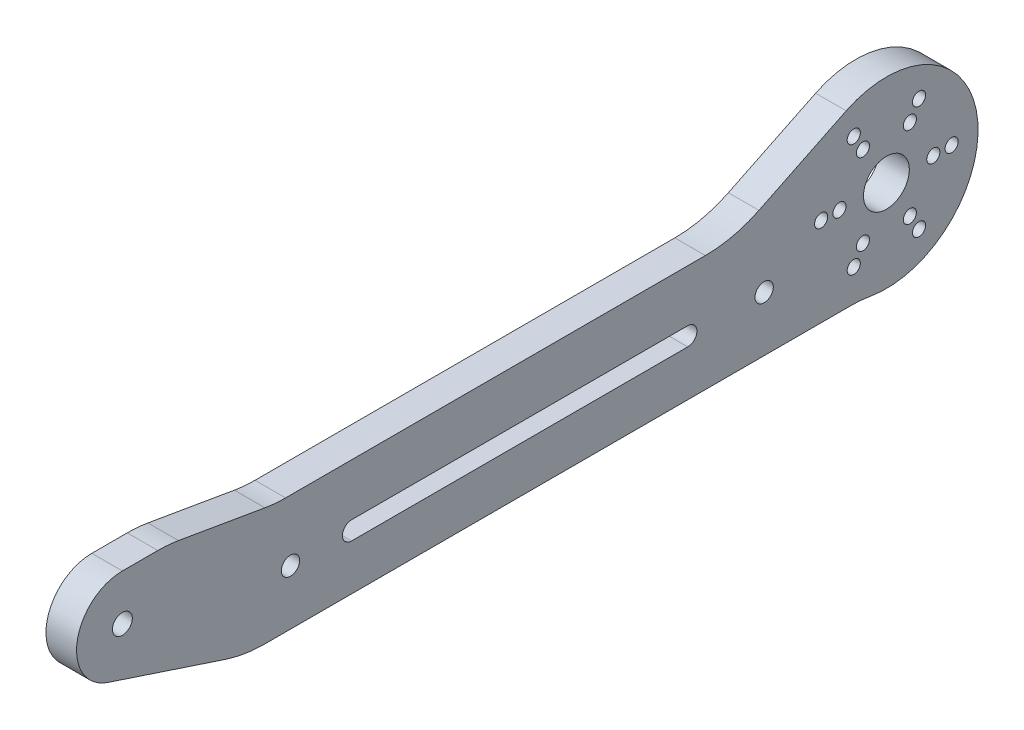
ISO-10303-21;
HEADER;
FILE_DESCRIPTION(('STEP AP214'),'2;1');
FILE_NAME('part.step','',(''),(''),'','','');
FILE_SCHEMA(('AUTOMOTIVE_DESIGN { 1 0 10303 214 1 1 1 1 }'));
ENDSEC;
DATA;
#1=APPLICATION_CONTEXT('core data for automotive mechanical design processes');
#2=APPLICATION_PROTOCOL_DEFINITION('international standard','automotive_design',2000,#1);
#3=PRODUCT_CONTEXT('',#1,'mechanical');
#4=PRODUCT('Part','Part','',(#3));
#5=PRODUCT_RELATED_PRODUCT_CATEGORY('part','',(#4));
#6=PRODUCT_DEFINITION_FORMATION('','',#4);
#7=PRODUCT_DEFINITION_CONTEXT('part definition',#1,'design');
#8=PRODUCT_DEFINITION('design','',#6,#7);
#9=PRODUCT_DEFINITION_SHAPE('','',#8);
#10=(LENGTH_UNIT() NAMED_UNIT(*) SI_UNIT(.MILLI.,.METRE.));
#11=(NAMED_UNIT(*) PLANE_ANGLE_UNIT() SI_UNIT($,.RADIAN.));
#12=(NAMED_UNIT(*) SI_UNIT($,.STERADIAN.) SOLID_ANGLE_UNIT());
#13=UNCERTAINTY_MEASURE_WITH_UNIT(LENGTH_MEASURE(1.E-05),#10,'distance_accuracy_value','');
#14=(GEOMETRIC_REPRESENTATION_CONTEXT(3) GLOBAL_UNCERTAINTY_ASSIGNED_CONTEXT((#13)) GLOBAL_UNIT_ASSIGNED_CONTEXT((#10,
#11,#12)) REPRESENTATION_CONTEXT('',''));
#15=CARTESIAN_POINT('',(0.,0.,0.));
#16=DIRECTION('',(0.,0.,1.));
#17=DIRECTION('',(1.,0.,0.));
#18=AXIS2_PLACEMENT_3D('',#15,#16,#17);
#19=CARTESIAN_POINT('',(-2.5,0.,0.));
#20=DIRECTION('',(1.,0.,0.));
#21=DIRECTION('',(0.,0.,-1.));
#22=AXIS2_PLACEMENT_3D('',#19,#20,#21);
#23=PLANE('',#22);
#24=CARTESIAN_POINT('',(-2.5,0.,125.));
#25=DIRECTION('',(-1.,0.,0.));
#26=DIRECTION('',(0.,0.,1.));
#27=AXIS2_PLACEMENT_3D('',#24,#25,#26);
#28=CIRCLE('',#27,1.62500000000002);
#29=CARTESIAN_POINT('',(-2.5,0.,126.625));
#30=VERTEX_POINT('',#29);
#31=EDGE_CURVE('E270',#30,#30,#28,.F.);
#32=ORIENTED_EDGE('',*,*,#31,.T.);
#33=EDGE_LOOP('',(#32));
#34=FACE_BOUND('',#33,.T.);
#35=CARTESIAN_POINT('',(-2.5,-5.50000000000001,97.5));
#36=DIRECTION('',(-1.,0.,0.));
#37=DIRECTION('',(0.,0.,1.));
#38=AXIS2_PLACEMENT_3D('',#35,#36,#37);
#39=CIRCLE('',#38,1.5);
#40=CARTESIAN_POINT('',(-2.5,-5.50000000000001,99.));
#41=VERTEX_POINT('',#40);
#42=EDGE_CURVE('E273',#41,#41,#39,.F.);
#43=ORIENTED_EDGE('',*,*,#42,.T.);
#44=EDGE_LOOP('',(#43));
#45=FACE_BOUND('',#44,.T.);
#46=CARTESIAN_POINT('',(-2.5,-5.5,20.));
#47=DIRECTION('',(-1.,0.,0.));
#48=DIRECTION('',(0.,0.,1.));
#49=AXIS2_PLACEMENT_3D('',#46,#47,#48);
#50=CIRCLE('',#49,1.5);
#51=CARTESIAN_POINT('',(-2.5,-5.5,21.5));
#52=VERTEX_POINT('',#51);
#53=EDGE_CURVE('E169',#52,#52,#50,.F.);
#54=ORIENTED_EDGE('',*,*,#53,.T.);
#55=EDGE_LOOP('',(#54));
#56=FACE_BOUND('',#55,.T.);
#57=DIRECTION('',(0.,0.,1.));
#58=VECTOR('',#57,1.);
#59=CARTESIAN_POINT('',(-2.5,-3.99999999999998,0.));
#60=LINE('',#59,#58);
#61=CARTESIAN_POINT('',(-2.5,-3.99999999999999,32.5));
#62=VERTEX_POINT('',#61);
#63=CARTESIAN_POINT('',(-2.5,-4.,87.5));
#64=VERTEX_POINT('',#63);
#65=EDGE_CURVE('E166',#62,#64,#60,.T.);
#66=ORIENTED_EDGE('',*,*,#65,.T.);
#67=CARTESIAN_POINT('',(-2.5,-5.5,87.5));
#68=DIRECTION('',(-1.,0.,0.));
#69=DIRECTION('',(0.,0.,1.));
#70=AXIS2_PLACEMENT_3D('',#67,#68,#69);
#71=CIRCLE('',#70,1.5);
#72=CARTESIAN_POINT('',(-2.5,-7.,87.5));
#73=VERTEX_POINT('',#72);
#74=EDGE_CURVE('E278',#64,#73,#71,.F.);
#75=ORIENTED_EDGE('',*,*,#74,.T.);
#76=DIRECTION('',(0.,0.,1.));
#77=VECTOR('',#76,1.);
#78=CARTESIAN_POINT('',(-2.5,-6.99999999999998,0.));
#79=LINE('',#78,#77);
#80=CARTESIAN_POINT('',(-2.5,-6.99999999999999,32.5));
#81=VERTEX_POINT('',#80);
#82=EDGE_CURVE('E171',#81,#73,#79,.T.);
#83=ORIENTED_EDGE('',*,*,#82,.F.);
#84=CARTESIAN_POINT('',(-2.5,-5.49999999999999,32.5));
#85=DIRECTION('',(-1.,0.,0.));
#86=DIRECTION('',(0.,0.,1.));
#87=AXIS2_PLACEMENT_3D('',#84,#85,#86);
#88=CIRCLE('',#87,1.5);
#89=EDGE_CURVE('E175',#81,#62,#88,.F.);
#90=ORIENTED_EDGE('',*,*,#89,.T.);
#91=EDGE_LOOP('',(#66,#75,#83,#90));
#92=FACE_BOUND('',#91,.T.);
#93=CARTESIAN_POINT('',(-2.5,-12.5,119.201872697098));
#94=DIRECTION('',(-1.,0.,0.));
#95=DIRECTION('',(0.,0.,1.));
#96=AXIS2_PLACEMENT_3D('',#93,#94,#95);
#97=CIRCLE('',#96,20.);
#98=CARTESIAN_POINT('',(-2.5,7.21244509626534,115.822596394881));
#99=VERTEX_POINT('',#98);
#100=CARTESIAN_POINT('',(-2.5,7.5,119.201872697098));
#101=VERTEX_POINT('',#100);
#102=EDGE_CURVE('E138',#99,#101,#97,.F.);
#103=ORIENTED_EDGE('',*,*,#102,.F.);
#104=DIRECTION('',(0.,0.168963815110846,0.985622254813267));
#105=VECTOR('',#104,1.);
#106=CARTESIAN_POINT('',(-2.5,-12.281919111816,2.10547184773989));
#107=LINE('',#106,#105);
#108=CARTESIAN_POINT('',(-2.5,4.78755490373467,101.677403605119));
#109=VERTEX_POINT('',#108);
#110=EDGE_CURVE('E133',#109,#99,#107,.T.);
#111=ORIENTED_EDGE('',*,*,#110,.F.);
#112=CARTESIAN_POINT('',(-2.5,24.5,98.2981273029019));
#113=DIRECTION('',(1.,0.,0.));
#114=DIRECTION('',(0.,0.,-1.));
#115=AXIS2_PLACEMENT_3D('',#112,#113,#114);
#116=CIRCLE('',#115,20.);
#117=CARTESIAN_POINT('',(-2.5,4.5,98.2981273029019));
#118=VERTEX_POINT('',#117);
#119=EDGE_CURVE('E284',#109,#118,#116,.T.);
#120=ORIENTED_EDGE('',*,*,#119,.T.);
#121=DIRECTION('',(0.,0.,1.));
#122=VECTOR('',#121,1.);
#123=CARTESIAN_POINT('',(-2.5,4.50000000000002,0.));
#124=LINE('',#123,#122);
#125=CARTESIAN_POINT('',(-2.5,4.50000000000001,29.6153846153846));
#126=VERTEX_POINT('',#125);
#127=EDGE_CURVE('E176',#126,#118,#124,.T.);
#128=ORIENTED_EDGE('',*,*,#127,.F.);
#129=CARTESIAN_POINT('',(-2.5,24.5,29.6153846153846));
#130=DIRECTION('',(1.,0.,0.));
#131=DIRECTION('',(0.,0.,-1.));
#132=AXIS2_PLACEMENT_3D('',#129,#130,#131);
#133=CIRCLE('',#132,20.);
#134=CARTESIAN_POINT('',(-2.5,6.52247191011236,20.8513396715644));
#135=VERTEX_POINT('',#134);
#136=EDGE_CURVE('E287',#126,#135,#133,.T.);
#137=ORIENTED_EDGE('',*,*,#136,.T.);
#138=DIRECTION('',(0.,-0.438202247191011,0.898876404494382));
#139=VECTOR('',#138,1.);
#140=CARTESIAN_POINT('',(-2.5,13.4831460674157,6.57303370786516));
#141=LINE('',#140,#139);
#142=CARTESIAN_POINT('',(-2.5,13.4831460674157,6.57303370786516));
#143=VERTEX_POINT('',#142);
#144=EDGE_CURVE('E183',#143,#135,#141,.T.);
#145=ORIENTED_EDGE('',*,*,#144,.F.);
#146=CARTESIAN_POINT('',(-2.5,0.,0.));
#147=DIRECTION('',(-1.,0.,0.));
#148=DIRECTION('',(0.,0.,1.));
#149=AXIS2_PLACEMENT_3D('',#146,#147,#148);
#150=CIRCLE('',#149,15.);
#151=CARTESIAN_POINT('',(-2.5,-14.7857142857143,2.52639131197534));
#152=VERTEX_POINT('',#151);
#153=EDGE_CURVE('E187',#152,#143,#150,.F.);
#154=ORIENTED_EDGE('',*,*,#153,.F.);
#155=CARTESIAN_POINT('',(-2.5,-34.5,5.8949130612758));
#156=DIRECTION('',(-1.,0.,0.));
#157=DIRECTION('',(0.,0.,1.));
#158=AXIS2_PLACEMENT_3D('',#155,#156,#157);
#159=CIRCLE('',#158,20.);
#160=CARTESIAN_POINT('',(-2.5,-14.5,5.8949130612758));
#161=VERTEX_POINT('',#160);
#162=EDGE_CURVE('E191',#152,#161,#159,.F.);
#163=ORIENTED_EDGE('',*,*,#162,.T.);
#164=DIRECTION('',(0.,0.,1.));
#165=VECTOR('',#164,1.);
#166=CARTESIAN_POINT('',(-2.5,-14.5,0.));
#167=LINE('',#166,#165);
#168=CARTESIAN_POINT('',(-2.5,-14.5,101.784359461928));
#169=VERTEX_POINT('',#168);
#170=EDGE_CURVE('E188',#161,#169,#167,.T.);
#171=ORIENTED_EDGE('',*,*,#170,.T.);
#172=CARTESIAN_POINT('',(-2.5,5.49999999999998,101.784359461928));
#173=DIRECTION('',(1.,0.,0.));
#174=DIRECTION('',(0.,0.,-1.));
#175=AXIS2_PLACEMENT_3D('',#172,#173,#174);
#176=CIRCLE('',#175,20.);
#177=CARTESIAN_POINT('',(-2.5,-13.4920226739072,108.05357590051));
#178=VERTEX_POINT('',#177);
#179=EDGE_CURVE('E294',#178,#169,#176,.T.);
#180=ORIENTED_EDGE('',*,*,#179,.F.);
#181=DIRECTION('',(0.,-0.313460821929136,-0.949601133695359));
#182=VECTOR('',#181,1.);
#183=CARTESIAN_POINT('',(-2.5,-44.3298524868385,14.6331670250297));
#184=LINE('',#183,#182);
#185=CARTESIAN_POINT('',(-2.5,-7.12200850271519,127.350956164469));
#186=VERTEX_POINT('',#185);
#187=EDGE_CURVE('E193',#186,#178,#184,.T.);
#188=ORIENTED_EDGE('',*,*,#187,.F.);
#189=CARTESIAN_POINT('',(-2.5,0.,125.));
#190=DIRECTION('',(-1.,0.,0.));
#191=DIRECTION('',(0.,0.,1.));
#192=AXIS2_PLACEMENT_3D('',#189,#190,#191);
#193=CIRCLE('',#192,7.50000000000001);
#194=CARTESIAN_POINT('',(-2.5,7.50000000000001,125.));
#195=VERTEX_POINT('',#194);
#196=EDGE_CURVE('E152',#195,#186,#193,.F.);
#197=ORIENTED_EDGE('',*,*,#196,.F.);
#198=DIRECTION('',(0.,0.,1.));
#199=VECTOR('',#198,1.);
#200=CARTESIAN_POINT('',(-2.5,7.4999999999998,0.));
#201=LINE('',#200,#199);
#202=EDGE_CURVE('E149',#101,#195,#201,.T.);
#203=ORIENTED_EDGE('',*,*,#202,.F.);
#204=EDGE_LOOP('',(#103,#111,#120,#128,#137,#145,#154,#163,#171,#180,#188,#197,#203));
#205=FACE_BOUND('',#204,.T.);
#206=CARTESIAN_POINT('',(-2.5,-6.64674497404557,-3.8375));
#207=DIRECTION('',(-1.,0.,0.));
#208=DIRECTION('',(0.,0.,1.));
#209=AXIS2_PLACEMENT_3D('',#206,#207,#208);
#210=CIRCLE('',#209,1.075);
#211=CARTESIAN_POINT('',(-2.5,-6.64674497404557,-2.7625));
#212=VERTEX_POINT('',#211);
#213=EDGE_CURVE('E182',#212,#212,#210,.F.);
#214=ORIENTED_EDGE('',*,*,#213,.T.);
#215=EDGE_LOOP('',(#214));
#216=FACE_BOUND('',#215,.T.);
#217=CARTESIAN_POINT('',(-2.5,-9.24482118539888,-5.3375));
#218=DIRECTION('',(-1.,0.,0.));
#219=DIRECTION('',(0.,0.,1.));
#220=AXIS2_PLACEMENT_3D('',#217,#218,#219);
#221=CIRCLE('',#220,1.075);
#222=CARTESIAN_POINT('',(-2.5,-9.24482118539888,-4.2625));
#223=VERTEX_POINT('',#222);
#224=EDGE_CURVE('E300',#223,#223,#221,.F.);
#225=ORIENTED_EDGE('',*,*,#224,.T.);
#226=EDGE_LOOP('',(#225));
#227=FACE_BOUND('',#226,.T.);
#228=CARTESIAN_POINT('',(-2.5,-6.64674497404557,3.8375));
#229=DIRECTION('',(-1.,0.,0.));
#230=DIRECTION('',(0.,0.,1.));
#231=AXIS2_PLACEMENT_3D('',#228,#229,#230);
#232=CIRCLE('',#231,1.075);
#233=CARTESIAN_POINT('',(-2.5,-6.64674497404557,4.9125));
#234=VERTEX_POINT('',#233);
#235=EDGE_CURVE('E303',#234,#234,#232,.F.);
#236=ORIENTED_EDGE('',*,*,#235,.T.);
#237=EDGE_LOOP('',(#236));
#238=FACE_BOUND('',#237,.T.);
#239=CARTESIAN_POINT('',(-2.5,-9.24482118539889,5.3375));
#240=DIRECTION('',(-1.,0.,0.));
#241=DIRECTION('',(0.,0.,1.));
#242=AXIS2_PLACEMENT_3D('',#239,#240,#241);
#243=CIRCLE('',#242,1.075);
#244=CARTESIAN_POINT('',(-2.5,-9.24482118539889,6.4125));
#245=VERTEX_POINT('',#244);
#246=EDGE_CURVE('E306',#245,#245,#243,.F.);
#247=ORIENTED_EDGE('',*,*,#246,.T.);
#248=EDGE_LOOP('',(#247));
#249=FACE_BOUND('',#248,.T.);
#250=CARTESIAN_POINT('',(-2.5,0.,7.675));
#251=DIRECTION('',(-1.,0.,0.));
#252=DIRECTION('',(0.,0.,1.));
#253=AXIS2_PLACEMENT_3D('',#250,#251,#252);
#254=CIRCLE('',#253,1.075);
#255=CARTESIAN_POINT('',(-2.5,0.,8.75));
#256=VERTEX_POINT('',#255);
#257=EDGE_CURVE('E309',#256,#256,#254,.F.);
#258=ORIENTED_EDGE('',*,*,#257,.T.);
#259=EDGE_LOOP('',(#258));
#260=FACE_BOUND('',#259,.T.);
#261=CARTESIAN_POINT('',(-2.5,0.,10.675));
#262=DIRECTION('',(-1.,0.,0.));
#263=DIRECTION('',(0.,0.,1.));
#264=AXIS2_PLACEMENT_3D('',#261,#262,#263);
#265=CIRCLE('',#264,1.075);
#266=CARTESIAN_POINT('',(-2.5,0.,11.75));
#267=VERTEX_POINT('',#266);
#268=EDGE_CURVE('E312',#267,#267,#265,.F.);
#269=ORIENTED_EDGE('',*,*,#268,.T.);
#270=EDGE_LOOP('',(#269));
#271=FACE_BOUND('',#270,.T.);
#272=CARTESIAN_POINT('',(-2.5,6.64674497404556,3.8375));
#273=DIRECTION('',(-1.,0.,0.));
#274=DIRECTION('',(0.,0.,1.));
#275=AXIS2_PLACEMENT_3D('',#272,#273,#274);
#276=CIRCLE('',#275,1.075);
#277=CARTESIAN_POINT('',(-2.5,6.64674497404556,4.9125));
#278=VERTEX_POINT('',#277);
#279=EDGE_CURVE('E315',#278,#278,#276,.F.);
#280=ORIENTED_EDGE('',*,*,#279,.T.);
#281=EDGE_LOOP('',(#280));
#282=FACE_BOUND('',#281,.T.);
#283=CARTESIAN_POINT('',(-2.5,9.24482118539888,5.33750000000001));
#284=DIRECTION('',(-1.,0.,0.));
#285=DIRECTION('',(0.,0.,1.));
#286=AXIS2_PLACEMENT_3D('',#283,#284,#285);
#287=CIRCLE('',#286,1.075);
#288=CARTESIAN_POINT('',(-2.5,9.24482118539888,6.4125));
#289=VERTEX_POINT('',#288);
#290=EDGE_CURVE('E318',#289,#289,#287,.F.);
#291=ORIENTED_EDGE('',*,*,#290,.T.);
#292=EDGE_LOOP('',(#291));
#293=FACE_BOUND('',#292,.T.);
#294=CARTESIAN_POINT('',(-2.5,6.64674497404557,-3.8375));
#295=DIRECTION('',(-1.,0.,0.));
#296=DIRECTION('',(0.,0.,1.));
#297=AXIS2_PLACEMENT_3D('',#294,#295,#296);
#298=CIRCLE('',#297,1.075);
#299=CARTESIAN_POINT('',(-2.5,6.64674497404557,-2.76249999999999));
#300=VERTEX_POINT('',#299);
#301=EDGE_CURVE('E321',#300,#300,#298,.F.);
#302=ORIENTED_EDGE('',*,*,#301,.T.);
#303=EDGE_LOOP('',(#302));
#304=FACE_BOUND('',#303,.T.);
#305=CARTESIAN_POINT('',(-2.5,9.24482118539889,-5.3375));
#306=DIRECTION('',(-1.,0.,0.));
#307=DIRECTION('',(0.,0.,1.));
#308=AXIS2_PLACEMENT_3D('',#305,#306,#307);
#309=CIRCLE('',#308,1.075);
#310=CARTESIAN_POINT('',(-2.5,9.24482118539889,-4.2625));
#311=VERTEX_POINT('',#310);
#312=EDGE_CURVE('E324',#311,#311,#309,.F.);
#313=ORIENTED_EDGE('',*,*,#312,.T.);
#314=EDGE_LOOP('',(#313));
#315=FACE_BOUND('',#314,.T.);
#316=CARTESIAN_POINT('',(-2.5,0.,0.));
#317=DIRECTION('',(-1.,0.,0.));
#318=DIRECTION('',(0.,0.,1.));
#319=AXIS2_PLACEMENT_3D('',#316,#317,#318);
#320=CIRCLE('',#319,3.75);
#321=CARTESIAN_POINT('',(-2.5,0.,3.75));
#322=VERTEX_POINT('',#321);
#323=EDGE_CURVE('E327',#322,#322,#320,.F.);
#324=ORIENTED_EDGE('',*,*,#323,.T.);
#325=EDGE_LOOP('',(#324));
#326=FACE_BOUND('',#325,.T.);
#327=CARTESIAN_POINT('',(-2.5,0.,-7.675));
#328=DIRECTION('',(-1.,0.,0.));
#329=DIRECTION('',(0.,0.,1.));
#330=AXIS2_PLACEMENT_3D('',#327,#328,#329);
#331=CIRCLE('',#330,1.075);
#332=CARTESIAN_POINT('',(-2.5,0.,-6.6));
#333=VERTEX_POINT('',#332);
#334=EDGE_CURVE('E329',#333,#333,#331,.F.);
#335=ORIENTED_EDGE('',*,*,#334,.T.);
#336=EDGE_LOOP('',(#335));
#337=FACE_BOUND('',#336,.T.);
#338=CARTESIAN_POINT('',(-2.5,0.,-10.675));
#339=DIRECTION('',(-1.,0.,0.));
#340=DIRECTION('',(0.,0.,1.));
#341=AXIS2_PLACEMENT_3D('',#338,#339,#340);
#342=CIRCLE('',#341,1.075);
#343=CARTESIAN_POINT('',(-2.5,0.,-9.6));
#344=VERTEX_POINT('',#343);
#345=EDGE_CURVE('E20',#344,#344,#342,.F.);
#346=ORIENTED_EDGE('',*,*,#345,.T.);
#347=EDGE_LOOP('',(#346));
#348=FACE_BOUND('',#347,.T.);
#349=ADVANCED_FACE('F17',(#34,#45,#56,#92,#205,#216,#227,#238,#249,#260,#271,#282,#293,#304,
#315,#326,#337,#348),#23,.F.);
#350=CARTESIAN_POINT('',(2.5,0.,-10.675));
#351=DIRECTION('',(-1.,0.,0.));
#352=DIRECTION('',(0.,0.,1.));
#353=AXIS2_PLACEMENT_3D('',#350,#351,#352);
#354=CYLINDRICAL_SURFACE('',#353,1.075);
#355=CARTESIAN_POINT('',(2.5,0.,-10.675));
#356=DIRECTION('',(-1.,0.,0.));
#357=DIRECTION('',(0.,0.,1.));
#358=AXIS2_PLACEMENT_3D('',#355,#356,#357);
#359=CIRCLE('',#358,1.075);
#360=CARTESIAN_POINT('',(2.5,0.,-9.6));
#361=VERTEX_POINT('',#360);
#362=EDGE_CURVE('E267',#361,#361,#359,.T.);
#363=ORIENTED_EDGE('',*,*,#362,.F.);
#364=EDGE_LOOP('',(#363));
#365=FACE_BOUND('',#364,.T.);
#366=ORIENTED_EDGE('',*,*,#345,.F.);
#367=EDGE_LOOP('',(#366));
#368=FACE_BOUND('',#367,.T.);
#369=ADVANCED_FACE('F337',(#365,#368),#354,.F.);
#370=CARTESIAN_POINT('',(2.5,0.,-7.675));
#371=DIRECTION('',(-1.,0.,0.));
#372=DIRECTION('',(0.,0.,1.));
#373=AXIS2_PLACEMENT_3D('',#370,#371,#372);
#374=CYLINDRICAL_SURFACE('',#373,1.075);
#375=CARTESIAN_POINT('',(2.5,0.,-7.675));
#376=DIRECTION('',(-1.,0.,0.));
#377=DIRECTION('',(0.,0.,1.));
#378=AXIS2_PLACEMENT_3D('',#375,#376,#377);
#379=CIRCLE('',#378,1.075);
#380=CARTESIAN_POINT('',(2.5,0.,-6.6));
#381=VERTEX_POINT('',#380);
#382=EDGE_CURVE('E264',#381,#381,#379,.T.);
#383=ORIENTED_EDGE('',*,*,#382,.F.);
#384=EDGE_LOOP('',(#383));
#385=FACE_BOUND('',#384,.T.);
#386=ORIENTED_EDGE('',*,*,#334,.F.);
#387=EDGE_LOOP('',(#386));
#388=FACE_BOUND('',#387,.T.);
#389=ADVANCED_FACE('F339',(#385,#388),#374,.F.);
#390=CARTESIAN_POINT('',(2.5,0.,0.));
#391=DIRECTION('',(-1.,0.,0.));
#392=DIRECTION('',(0.,0.,1.));
#393=AXIS2_PLACEMENT_3D('',#390,#391,#392);
#394=CYLINDRICAL_SURFACE('',#393,3.75);
#395=CARTESIAN_POINT('',(2.5,0.,0.));
#396=DIRECTION('',(-1.,0.,0.));
#397=DIRECTION('',(0.,0.,1.));
#398=AXIS2_PLACEMENT_3D('',#395,#396,#397);
#399=CIRCLE('',#398,3.75);
#400=CARTESIAN_POINT('',(2.5,0.,3.75));
#401=VERTEX_POINT('',#400);
#402=EDGE_CURVE('E261',#401,#401,#399,.T.);
#403=ORIENTED_EDGE('',*,*,#402,.F.);
#404=EDGE_LOOP('',(#403));
#405=FACE_BOUND('',#404,.T.);
#406=ORIENTED_EDGE('',*,*,#323,.F.);
#407=EDGE_LOOP('',(#406));
#408=FACE_BOUND('',#407,.T.);
#409=ADVANCED_FACE('F346',(#405,#408),#394,.F.);
#410=CARTESIAN_POINT('',(2.5,9.24482118539889,-5.3375));
#411=DIRECTION('',(-1.,0.,0.));
#412=DIRECTION('',(0.,0.,1.));
#413=AXIS2_PLACEMENT_3D('',#410,#411,#412);
#414=CYLINDRICAL_SURFACE('',#413,1.075);
#415=CARTESIAN_POINT('',(2.5,9.24482118539889,-5.3375));
#416=DIRECTION('',(-1.,0.,0.));
#417=DIRECTION('',(0.,0.,1.));
#418=AXIS2_PLACEMENT_3D('',#415,#416,#417);
#419=CIRCLE('',#418,1.075);
#420=CARTESIAN_POINT('',(2.5,9.24482118539889,-4.2625));
#421=VERTEX_POINT('',#420);
#422=EDGE_CURVE('E258',#421,#421,#419,.T.);
#423=ORIENTED_EDGE('',*,*,#422,.F.);
#424=EDGE_LOOP('',(#423));
#425=FACE_BOUND('',#424,.T.);
#426=ORIENTED_EDGE('',*,*,#312,.F.);
#427=EDGE_LOOP('',(#426));
#428=FACE_BOUND('',#427,.T.);
#429=ADVANCED_FACE('F469',(#425,#428),#414,.F.);
#430=CARTESIAN_POINT('',(2.5,6.64674497404557,-3.8375));
#431=DIRECTION('',(-1.,0.,0.));
#432=DIRECTION('',(0.,0.,1.));
#433=AXIS2_PLACEMENT_3D('',#430,#431,#432);
#434=CYLINDRICAL_SURFACE('',#433,1.075);
#435=CARTESIAN_POINT('',(2.5,6.64674497404557,-3.8375));
#436=DIRECTION('',(-1.,0.,0.));
#437=DIRECTION('',(0.,0.,1.));
#438=AXIS2_PLACEMENT_3D('',#435,#436,#437);
#439=CIRCLE('',#438,1.075);
#440=CARTESIAN_POINT('',(2.5,6.64674497404557,-2.76249999999999));
#441=VERTEX_POINT('',#440);
#442=EDGE_CURVE('E255',#441,#441,#439,.T.);
#443=ORIENTED_EDGE('',*,*,#442,.F.);
#444=EDGE_LOOP('',(#443));
#445=FACE_BOUND('',#444,.T.);
#446=ORIENTED_EDGE('',*,*,#301,.F.);
#447=EDGE_LOOP('',(#446));
#448=FACE_BOUND('',#447,.T.);
#449=ADVANCED_FACE('F465',(#445,#448),#434,.F.);
#450=CARTESIAN_POINT('',(2.5,9.24482118539888,5.33750000000001));
#451=DIRECTION('',(-1.,0.,0.));
#452=DIRECTION('',(0.,0.,1.));
#453=AXIS2_PLACEMENT_3D('',#450,#451,#452);
#454=CYLINDRICAL_SURFACE('',#453,1.075);
#455=CARTESIAN_POINT('',(2.5,9.24482118539888,5.33750000000001));
#456=DIRECTION('',(-1.,0.,0.));
#457=DIRECTION('',(0.,0.,1.));
#458=AXIS2_PLACEMENT_3D('',#455,#456,#457);
#459=CIRCLE('',#458,1.075);
#460=CARTESIAN_POINT('',(2.5,9.24482118539888,6.4125));
#461=VERTEX_POINT('',#460);
#462=EDGE_CURVE('E252',#461,#461,#459,.T.);
#463=ORIENTED_EDGE('',*,*,#462,.F.);
#464=EDGE_LOOP('',(#463));
#465=FACE_BOUND('',#464,.T.);
#466=ORIENTED_EDGE('',*,*,#290,.F.);
#467=EDGE_LOOP('',(#466));
#468=FACE_BOUND('',#467,.T.);
#469=ADVANCED_FACE('F461',(#465,#468),#454,.F.);
#470=CARTESIAN_POINT('',(2.5,6.64674497404556,3.8375));
#471=DIRECTION('',(-1.,0.,0.));
#472=DIRECTION('',(0.,0.,1.));
#473=AXIS2_PLACEMENT_3D('',#470,#471,#472);
#474=CYLINDRICAL_SURFACE('',#473,1.075);
#475=CARTESIAN_POINT('',(2.5,6.64674497404556,3.8375));
#476=DIRECTION('',(-1.,0.,0.));
#477=DIRECTION('',(0.,0.,1.));
#478=AXIS2_PLACEMENT_3D('',#475,#476,#477);
#479=CIRCLE('',#478,1.075);
#480=CARTESIAN_POINT('',(2.5,6.64674497404556,4.9125));
#481=VERTEX_POINT('',#480);
#482=EDGE_CURVE('E249',#481,#481,#479,.T.);
#483=ORIENTED_EDGE('',*,*,#482,.F.);
#484=EDGE_LOOP('',(#483));
#485=FACE_BOUND('',#484,.T.);
#486=ORIENTED_EDGE('',*,*,#279,.F.);
#487=EDGE_LOOP('',(#486));
#488=FACE_BOUND('',#487,.T.);
#489=ADVANCED_FACE('F457',(#485,#488),#474,.F.);
#490=CARTESIAN_POINT('',(2.5,0.,10.675));
#491=DIRECTION('',(-1.,0.,0.));
#492=DIRECTION('',(0.,0.,1.));
#493=AXIS2_PLACEMENT_3D('',#490,#491,#492);
#494=CYLINDRICAL_SURFACE('',#493,1.075);
#495=CARTESIAN_POINT('',(2.5,0.,10.675));
#496=DIRECTION('',(-1.,0.,0.));
#497=DIRECTION('',(0.,0.,1.));
#498=AXIS2_PLACEMENT_3D('',#495,#496,#497);
#499=CIRCLE('',#498,1.075);
#500=CARTESIAN_POINT('',(2.5,0.,11.75));
#501=VERTEX_POINT('',#500);
#502=EDGE_CURVE('E246',#501,#501,#499,.T.);
#503=ORIENTED_EDGE('',*,*,#502,.F.);
#504=EDGE_LOOP('',(#503));
#505=FACE_BOUND('',#504,.T.);
#506=ORIENTED_EDGE('',*,*,#268,.F.);
#507=EDGE_LOOP('',(#506));
#508=FACE_BOUND('',#507,.T.);
#509=ADVANCED_FACE('F453',(#505,#508),#494,.F.);
#510=CARTESIAN_POINT('',(2.5,0.,7.675));
#511=DIRECTION('',(-1.,0.,0.));
#512=DIRECTION('',(0.,0.,1.));
#513=AXIS2_PLACEMENT_3D('',#510,#511,#512);
#514=CYLINDRICAL_SURFACE('',#513,1.075);
#515=CARTESIAN_POINT('',(2.5,0.,7.675));
#516=DIRECTION('',(-1.,0.,0.));
#517=DIRECTION('',(0.,0.,1.));
#518=AXIS2_PLACEMENT_3D('',#515,#516,#517);
#519=CIRCLE('',#518,1.075);
#520=CARTESIAN_POINT('',(2.5,0.,8.75));
#521=VERTEX_POINT('',#520);
#522=EDGE_CURVE('E243',#521,#521,#519,.T.);
#523=ORIENTED_EDGE('',*,*,#522,.F.);
#524=EDGE_LOOP('',(#523));
#525=FACE_BOUND('',#524,.T.);
#526=ORIENTED_EDGE('',*,*,#257,.F.);
#527=EDGE_LOOP('',(#526));
#528=FACE_BOUND('',#527,.T.);
#529=ADVANCED_FACE('F449',(#525,#528),#514,.F.);
#530=CARTESIAN_POINT('',(2.5,-9.24482118539889,5.3375));
#531=DIRECTION('',(-1.,0.,0.));
#532=DIRECTION('',(0.,0.,1.));
#533=AXIS2_PLACEMENT_3D('',#530,#531,#532);
#534=CYLINDRICAL_SURFACE('',#533,1.075);
#535=CARTESIAN_POINT('',(2.5,-9.24482118539889,5.3375));
#536=DIRECTION('',(-1.,0.,0.));
#537=DIRECTION('',(0.,0.,1.));
#538=AXIS2_PLACEMENT_3D('',#535,#536,#537);
#539=CIRCLE('',#538,1.075);
#540=CARTESIAN_POINT('',(2.5,-9.24482118539889,6.4125));
#541=VERTEX_POINT('',#540);
#542=EDGE_CURVE('E240',#541,#541,#539,.T.);
#543=ORIENTED_EDGE('',*,*,#542,.F.);
#544=EDGE_LOOP('',(#543));
#545=FACE_BOUND('',#544,.T.);
#546=ORIENTED_EDGE('',*,*,#246,.F.);
#547=EDGE_LOOP('',(#546));
#548=FACE_BOUND('',#547,.T.);
#549=ADVANCED_FACE('F445',(#545,#548),#534,.F.);
#550=CARTESIAN_POINT('',(2.5,-6.64674497404557,3.8375));
#551=DIRECTION('',(-1.,0.,0.));
#552=DIRECTION('',(0.,0.,1.));
#553=AXIS2_PLACEMENT_3D('',#550,#551,#552);
#554=CYLINDRICAL_SURFACE('',#553,1.075);
#555=CARTESIAN_POINT('',(2.5,-6.64674497404557,3.8375));
#556=DIRECTION('',(-1.,0.,0.));
#557=DIRECTION('',(0.,0.,1.));
#558=AXIS2_PLACEMENT_3D('',#555,#556,#557);
#559=CIRCLE('',#558,1.075);
#560=CARTESIAN_POINT('',(2.5,-6.64674497404557,4.9125));
#561=VERTEX_POINT('',#560);
#562=EDGE_CURVE('E237',#561,#561,#559,.T.);
#563=ORIENTED_EDGE('',*,*,#562,.F.);
#564=EDGE_LOOP('',(#563));
#565=FACE_BOUND('',#564,.T.);
#566=ORIENTED_EDGE('',*,*,#235,.F.);
#567=EDGE_LOOP('',(#566));
#568=FACE_BOUND('',#567,.T.);
#569=ADVANCED_FACE('F441',(#565,#568),#554,.F.);
#570=CARTESIAN_POINT('',(2.5,-9.24482118539888,-5.3375));
#571=DIRECTION('',(-1.,0.,0.));
#572=DIRECTION('',(0.,0.,1.));
#573=AXIS2_PLACEMENT_3D('',#570,#571,#572);
#574=CYLINDRICAL_SURFACE('',#573,1.075);
#575=CARTESIAN_POINT('',(2.5,-9.24482118539888,-5.3375));
#576=DIRECTION('',(-1.,0.,0.));
#577=DIRECTION('',(0.,0.,1.));
#578=AXIS2_PLACEMENT_3D('',#575,#576,#577);
#579=CIRCLE('',#578,1.075);
#580=CARTESIAN_POINT('',(2.5,-9.24482118539888,-4.2625));
#581=VERTEX_POINT('',#580);
#582=EDGE_CURVE('E234',#581,#581,#579,.T.);
#583=ORIENTED_EDGE('',*,*,#582,.F.);
#584=EDGE_LOOP('',(#583));
#585=FACE_BOUND('',#584,.T.);
#586=ORIENTED_EDGE('',*,*,#224,.F.);
#587=EDGE_LOOP('',(#586));
#588=FACE_BOUND('',#587,.T.);
#589=ADVANCED_FACE('F437',(#585,#588),#574,.F.);
#590=CARTESIAN_POINT('',(2.5,-6.64674497404557,-3.8375));
#591=DIRECTION('',(-1.,0.,0.));
#592=DIRECTION('',(0.,0.,1.));
#593=AXIS2_PLACEMENT_3D('',#590,#591,#592);
#594=CYLINDRICAL_SURFACE('',#593,1.075);
#595=CARTESIAN_POINT('',(2.5,-6.64674497404557,-3.8375));
#596=DIRECTION('',(-1.,0.,0.));
#597=DIRECTION('',(0.,0.,1.));
#598=AXIS2_PLACEMENT_3D('',#595,#596,#597);
#599=CIRCLE('',#598,1.075);
#600=CARTESIAN_POINT('',(2.5,-6.64674497404557,-2.7625));
#601=VERTEX_POINT('',#600);
#602=EDGE_CURVE('E231',#601,#601,#599,.T.);
#603=ORIENTED_EDGE('',*,*,#602,.F.);
#604=EDGE_LOOP('',(#603));
#605=FACE_BOUND('',#604,.T.);
#606=ORIENTED_EDGE('',*,*,#213,.F.);
#607=EDGE_LOOP('',(#606));
#608=FACE_BOUND('',#607,.T.);
#609=ADVANCED_FACE('F434',(#605,#608),#594,.F.);
#610=CARTESIAN_POINT('',(2.5,-12.281919111816,2.10547184773989));
#611=DIRECTION('',(0.,0.985622254813267,-0.168963815110846));
#612=DIRECTION('',(0.,0.168963815110846,0.985622254813267));
#613=AXIS2_PLACEMENT_3D('',#610,#611,#612);
#614=PLANE('',#613);
#615=DIRECTION('',(0.,0.168963815110846,0.985622254813267));
#616=VECTOR('',#615,1.);
#617=CARTESIAN_POINT('',(2.5,4.78755490373467,101.677403605119));
#618=LINE('',#617,#616);
#619=CARTESIAN_POINT('',(2.5,4.78755490373467,101.677403605119));
#620=VERTEX_POINT('',#619);
#621=CARTESIAN_POINT('',(2.5,7.21244509626533,115.822596394881));
#622=VERTEX_POINT('',#621);
#623=EDGE_CURVE('E230',#620,#622,#618,.T.);
#624=ORIENTED_EDGE('',*,*,#623,.F.);
#625=DIRECTION('',(1.,0.,0.));
#626=VECTOR('',#625,1.);
#627=CARTESIAN_POINT('',(2.5,4.78755490373467,101.677403605119));
#628=LINE('',#627,#626);
#629=EDGE_CURVE('E286',#620,#109,#628,.F.);
#630=ORIENTED_EDGE('',*,*,#629,.T.);
#631=ORIENTED_EDGE('',*,*,#110,.T.);
#632=DIRECTION('',(-1.,0.,0.));
#633=VECTOR('',#632,1.);
#634=CARTESIAN_POINT('',(2.5,7.21244509626533,115.822596394881));
#635=LINE('',#634,#633);
#636=EDGE_CURVE('E145',#622,#99,#635,.T.);
#637=ORIENTED_EDGE('',*,*,#636,.F.);
#638=EDGE_LOOP('',(#624,#630,#631,#637));
#639=FACE_BOUND('',#638,.T.);
#640=ADVANCED_FACE('F431',(#639),#614,.T.);
#641=CARTESIAN_POINT('',(2.5,-12.5,119.201872697098));
#642=DIRECTION('',(-1.,0.,0.));
#643=DIRECTION('',(0.,0.,1.));
#644=AXIS2_PLACEMENT_3D('',#641,#642,#643);
#645=CYLINDRICAL_SURFACE('',#644,20.);
#646=ORIENTED_EDGE('',*,*,#102,.T.);
#647=DIRECTION('',(1.,0.,0.));
#648=VECTOR('',#647,1.);
#649=CARTESIAN_POINT('',(2.5,7.5,119.201872697098));
#650=LINE('',#649,#648);
#651=CARTESIAN_POINT('',(2.5,7.5,119.201872697098));
#652=VERTEX_POINT('',#651);
#653=EDGE_CURVE('E143',#652,#101,#650,.F.);
#654=ORIENTED_EDGE('',*,*,#653,.F.);
#655=CARTESIAN_POINT('',(2.5,-12.5,119.201872697098));
#656=DIRECTION('',(-1.,0.,0.));
#657=DIRECTION('',(0.,0.,1.));
#658=AXIS2_PLACEMENT_3D('',#655,#656,#657);
#659=CIRCLE('',#658,20.);
#660=EDGE_CURVE('E228',#622,#652,#659,.F.);
#661=ORIENTED_EDGE('',*,*,#660,.F.);
#662=ORIENTED_EDGE('',*,*,#636,.T.);
#663=EDGE_LOOP('',(#646,#654,#661,#662));
#664=FACE_BOUND('',#663,.T.);
#665=ADVANCED_FACE('F140',(#664),#645,.T.);
#666=CARTESIAN_POINT('',(2.5,7.4999999999998,0.));
#667=DIRECTION('',(0.,1.,0.));
#668=DIRECTION('',(0.,0.,1.));
#669=AXIS2_PLACEMENT_3D('',#666,#667,#668);
#670=PLANE('',#669);
#671=ORIENTED_EDGE('',*,*,#202,.T.);
#672=DIRECTION('',(-1.,0.,0.));
#673=VECTOR('',#672,1.);
#674=CARTESIAN_POINT('',(2.5,7.50000000000001,125.));
#675=LINE('',#674,#673);
#676=CARTESIAN_POINT('',(2.5,7.50000000000001,125.));
#677=VERTEX_POINT('',#676);
#678=EDGE_CURVE('E155',#677,#195,#675,.T.);
#679=ORIENTED_EDGE('',*,*,#678,.F.);
#680=DIRECTION('',(0.,0.,-1.));
#681=VECTOR('',#680,1.);
#682=CARTESIAN_POINT('',(2.5,7.5,0.));
#683=LINE('',#682,#681);
#684=EDGE_CURVE('E159',#652,#677,#683,.F.);
#685=ORIENTED_EDGE('',*,*,#684,.F.);
#686=ORIENTED_EDGE('',*,*,#653,.T.);
#687=EDGE_LOOP('',(#671,#679,#685,#686));
#688=FACE_BOUND('',#687,.T.);
#689=ADVANCED_FACE('F157',(#688),#670,.T.);
#690=CARTESIAN_POINT('',(2.5,0.,125.));
#691=DIRECTION('',(-1.,0.,0.));
#692=DIRECTION('',(0.,0.,1.));
#693=AXIS2_PLACEMENT_3D('',#690,#691,#692);
#694=CYLINDRICAL_SURFACE('',#693,7.50000000000001);
#695=ORIENTED_EDGE('',*,*,#196,.T.);
#696=DIRECTION('',(1.,0.,0.));
#697=VECTOR('',#696,1.);
#698=CARTESIAN_POINT('',(2.5,-7.12200850271519,127.350956164469));
#699=LINE('',#698,#697);
#700=CARTESIAN_POINT('',(2.5,-7.12200850271519,127.350956164469));
#701=VERTEX_POINT('',#700);
#702=EDGE_CURVE('E194',#701,#186,#699,.F.);
#703=ORIENTED_EDGE('',*,*,#702,.F.);
#704=CARTESIAN_POINT('',(2.5,0.,125.));
#705=DIRECTION('',(-1.,0.,0.));
#706=DIRECTION('',(0.,0.,1.));
#707=AXIS2_PLACEMENT_3D('',#704,#705,#706);
#708=CIRCLE('',#707,7.50000000000001);
#709=EDGE_CURVE('E226',#677,#701,#708,.F.);
#710=ORIENTED_EDGE('',*,*,#709,.F.);
#711=ORIENTED_EDGE('',*,*,#678,.T.);
#712=EDGE_LOOP('',(#695,#703,#710,#711));
#713=FACE_BOUND('',#712,.T.);
#714=ADVANCED_FACE('F422',(#713),#694,.T.);
#715=CARTESIAN_POINT('',(2.5,-44.3298524868385,14.6331670250297));
#716=DIRECTION('',(0.,-0.949601133695359,0.313460821929136));
#717=DIRECTION('',(0.,-0.313460821929136,-0.949601133695359));
#718=AXIS2_PLACEMENT_3D('',#715,#716,#717);
#719=PLANE('',#718);
#720=DIRECTION('',(0.,-0.313460821929136,-0.949601133695359));
#721=VECTOR('',#720,1.);
#722=CARTESIAN_POINT('',(2.5,-7.1220085027152,127.350956164469));
#723=LINE('',#722,#721);
#724=CARTESIAN_POINT('',(2.5,-13.4920226739072,108.05357590051));
#725=VERTEX_POINT('',#724);
#726=EDGE_CURVE('E225',#701,#725,#723,.T.);
#727=ORIENTED_EDGE('',*,*,#726,.F.);
#728=ORIENTED_EDGE('',*,*,#702,.T.);
#729=ORIENTED_EDGE('',*,*,#187,.T.);
#730=DIRECTION('',(1.,0.,0.));
#731=VECTOR('',#730,1.);
#732=CARTESIAN_POINT('',(2.5,-13.4920226739072,108.05357590051));
#733=LINE('',#732,#731);
#734=EDGE_CURVE('E296',#725,#178,#733,.F.);
#735=ORIENTED_EDGE('',*,*,#734,.F.);
#736=EDGE_LOOP('',(#727,#728,#729,#735));
#737=FACE_BOUND('',#736,.T.);
#738=ADVANCED_FACE('F418',(#737),#719,.T.);
#739=CARTESIAN_POINT('',(2.5,5.49999999999998,101.784359461928));
#740=DIRECTION('',(1.,0.,0.));
#741=DIRECTION('',(0.,0.,-1.));
#742=AXIS2_PLACEMENT_3D('',#739,#740,#741);
#743=CYLINDRICAL_SURFACE('',#742,20.);
#744=ORIENTED_EDGE('',*,*,#179,.T.);
#745=DIRECTION('',(1.,0.,0.));
#746=VECTOR('',#745,1.);
#747=CARTESIAN_POINT('',(2.5,-14.5,101.784359461928));
#748=LINE('',#747,#746);
#749=CARTESIAN_POINT('',(2.5,-14.5,101.784359461928));
#750=VERTEX_POINT('',#749);
#751=EDGE_CURVE('E192',#169,#750,#748,.T.);
#752=ORIENTED_EDGE('',*,*,#751,.T.);
#753=CARTESIAN_POINT('',(2.5,5.49999999999998,101.784359461928));
#754=DIRECTION('',(1.,0.,0.));
#755=DIRECTION('',(0.,0.,-1.));
#756=AXIS2_PLACEMENT_3D('',#753,#754,#755);
#757=CIRCLE('',#756,20.);
#758=EDGE_CURVE('E222',#725,#750,#757,.T.);
#759=ORIENTED_EDGE('',*,*,#758,.F.);
#760=ORIENTED_EDGE('',*,*,#734,.T.);
#761=EDGE_LOOP('',(#744,#752,#759,#760));
#762=FACE_BOUND('',#761,.T.);
#763=ADVANCED_FACE('F414',(#762),#743,.T.);
#764=CARTESIAN_POINT('',(2.5,-14.5,0.));
#765=DIRECTION('',(0.,1.,0.));
#766=DIRECTION('',(0.,0.,1.));
#767=AXIS2_PLACEMENT_3D('',#764,#765,#766);
#768=PLANE('',#767);
#769=DIRECTION('',(-1.,0.,0.));
#770=VECTOR('',#769,1.);
#771=CARTESIAN_POINT('',(2.5,-14.5,5.8949130612758));
#772=LINE('',#771,#770);
#773=CARTESIAN_POINT('',(2.5,-14.5,5.8949130612758));
#774=VERTEX_POINT('',#773);
#775=EDGE_CURVE('E293',#161,#774,#772,.F.);
#776=ORIENTED_EDGE('',*,*,#775,.T.);
#777=DIRECTION('',(0.,0.,-1.));
#778=VECTOR('',#777,1.);
#779=CARTESIAN_POINT('',(2.5,-14.5,0.));
#780=LINE('',#779,#778);
#781=EDGE_CURVE('E221',#750,#774,#780,.T.);
#782=ORIENTED_EDGE('',*,*,#781,.F.);
#783=ORIENTED_EDGE('',*,*,#751,.F.);
#784=ORIENTED_EDGE('',*,*,#170,.F.);
#785=EDGE_LOOP('',(#776,#782,#783,#784));
#786=FACE_BOUND('',#785,.T.);
#787=ADVANCED_FACE('F410',(#786),#768,.F.);
#788=CARTESIAN_POINT('',(2.5,-34.5,5.8949130612758));
#789=DIRECTION('',(-1.,0.,0.));
#790=DIRECTION('',(0.,0.,1.));
#791=AXIS2_PLACEMENT_3D('',#788,#789,#790);
#792=CYLINDRICAL_SURFACE('',#791,20.);
#793=ORIENTED_EDGE('',*,*,#775,.F.);
#794=ORIENTED_EDGE('',*,*,#162,.F.);
#795=DIRECTION('',(-1.,0.,0.));
#796=VECTOR('',#795,1.);
#797=CARTESIAN_POINT('',(2.5,-14.7857142857143,2.52639131197534));
#798=LINE('',#797,#796);
#799=CARTESIAN_POINT('',(2.5,-14.7857142857143,2.52639131197534));
#800=VERTEX_POINT('',#799);
#801=EDGE_CURVE('E291',#800,#152,#798,.T.);
#802=ORIENTED_EDGE('',*,*,#801,.F.);
#803=CARTESIAN_POINT('',(2.5,-34.5,5.8949130612758));
#804=DIRECTION('',(-1.,0.,0.));
#805=DIRECTION('',(0.,0.,1.));
#806=AXIS2_PLACEMENT_3D('',#803,#804,#805);
#807=CIRCLE('',#806,20.);
#808=EDGE_CURVE('E218',#774,#800,#807,.T.);
#809=ORIENTED_EDGE('',*,*,#808,.F.);
#810=EDGE_LOOP('',(#793,#794,#802,#809));
#811=FACE_BOUND('',#810,.T.);
#812=ADVANCED_FACE('F406',(#811),#792,.F.);
#813=CARTESIAN_POINT('',(2.5,0.,0.));
#814=DIRECTION('',(-1.,0.,0.));
#815=DIRECTION('',(0.,0.,1.));
#816=AXIS2_PLACEMENT_3D('',#813,#814,#815);
#817=CYLINDRICAL_SURFACE('',#816,15.);
#818=ORIENTED_EDGE('',*,*,#153,.T.);
#819=DIRECTION('',(1.,0.,0.));
#820=VECTOR('',#819,1.);
#821=CARTESIAN_POINT('',(2.5,13.4831460674157,6.57303370786516));
#822=LINE('',#821,#820);
#823=CARTESIAN_POINT('',(2.5,13.4831460674157,6.57303370786516));
#824=VERTEX_POINT('',#823);
#825=EDGE_CURVE('E186',#824,#143,#822,.F.);
#826=ORIENTED_EDGE('',*,*,#825,.F.);
#827=CARTESIAN_POINT('',(2.5,0.,0.));
#828=DIRECTION('',(-1.,0.,0.));
#829=DIRECTION('',(0.,0.,1.));
#830=AXIS2_PLACEMENT_3D('',#827,#828,#829);
#831=CIRCLE('',#830,15.);
#832=EDGE_CURVE('E215',#800,#824,#831,.F.);
#833=ORIENTED_EDGE('',*,*,#832,.F.);
#834=ORIENTED_EDGE('',*,*,#801,.T.);
#835=EDGE_LOOP('',(#818,#826,#833,#834));
#836=FACE_BOUND('',#835,.T.);
#837=ADVANCED_FACE('F402',(#836),#817,.T.);
#838=CARTESIAN_POINT('',(2.5,13.4831460674157,6.57303370786516));
#839=DIRECTION('',(0.,0.898876404494382,0.438202247191011));
#840=DIRECTION('',(0.,-0.438202247191011,0.898876404494382));
#841=AXIS2_PLACEMENT_3D('',#838,#839,#840);
#842=PLANE('',#841);
#843=DIRECTION('',(0.,-0.438202247191011,0.898876404494382));
#844=VECTOR('',#843,1.);
#845=CARTESIAN_POINT('',(2.5,13.4831460674157,6.57303370786516));
#846=LINE('',#845,#844);
#847=CARTESIAN_POINT('',(2.5,6.52247191011236,20.8513396715644));
#848=VERTEX_POINT('',#847);
#849=EDGE_CURVE('E214',#824,#848,#846,.T.);
#850=ORIENTED_EDGE('',*,*,#849,.F.);
#851=ORIENTED_EDGE('',*,*,#825,.T.);
#852=ORIENTED_EDGE('',*,*,#144,.T.);
#853=DIRECTION('',(1.,0.,0.));
#854=VECTOR('',#853,1.);
#855=CARTESIAN_POINT('',(2.5,6.52247191011236,20.8513396715644));
#856=LINE('',#855,#854);
#857=EDGE_CURVE('E180',#135,#848,#856,.T.);
#858=ORIENTED_EDGE('',*,*,#857,.T.);
#859=EDGE_LOOP('',(#850,#851,#852,#858));
#860=FACE_BOUND('',#859,.T.);
#861=ADVANCED_FACE('F398',(#860),#842,.T.);
#862=CARTESIAN_POINT('',(2.5,24.5,29.6153846153846));
#863=DIRECTION('',(1.,0.,0.));
#864=DIRECTION('',(0.,0.,-1.));
#865=AXIS2_PLACEMENT_3D('',#862,#863,#864);
#866=CYLINDRICAL_SURFACE('',#865,20.);
#867=ORIENTED_EDGE('',*,*,#857,.F.);
#868=ORIENTED_EDGE('',*,*,#136,.F.);
#869=DIRECTION('',(1.,0.,0.));
#870=VECTOR('',#869,1.);
#871=CARTESIAN_POINT('',(2.5,4.50000000000001,29.6153846153846));
#872=LINE('',#871,#870);
#873=CARTESIAN_POINT('',(2.5,4.50000000000001,29.6153846153846));
#874=VERTEX_POINT('',#873);
#875=EDGE_CURVE('E179',#874,#126,#872,.F.);
#876=ORIENTED_EDGE('',*,*,#875,.F.);
#877=CARTESIAN_POINT('',(2.5,24.5,29.6153846153846));
#878=DIRECTION('',(1.,0.,0.));
#879=DIRECTION('',(0.,0.,-1.));
#880=AXIS2_PLACEMENT_3D('',#877,#878,#879);
#881=CIRCLE('',#880,20.);
#882=EDGE_CURVE('E211',#848,#874,#881,.F.);
#883=ORIENTED_EDGE('',*,*,#882,.F.);
#884=EDGE_LOOP('',(#867,#868,#876,#883));
#885=FACE_BOUND('',#884,.T.);
#886=ADVANCED_FACE('F394',(#885),#866,.F.);
#887=CARTESIAN_POINT('',(2.5,4.50000000000002,0.));
#888=DIRECTION('',(0.,1.,0.));
#889=DIRECTION('',(0.,0.,1.));
#890=AXIS2_PLACEMENT_3D('',#887,#888,#889);
#891=PLANE('',#890);
#892=DIRECTION('',(0.,0.,-1.));
#893=VECTOR('',#892,1.);
#894=CARTESIAN_POINT('',(2.5,4.50000000000001,0.));
#895=LINE('',#894,#893);
#896=CARTESIAN_POINT('',(2.5,4.5,98.2981273029019));
#897=VERTEX_POINT('',#896);
#898=EDGE_CURVE('E210',#874,#897,#895,.F.);
#899=ORIENTED_EDGE('',*,*,#898,.F.);
#900=ORIENTED_EDGE('',*,*,#875,.T.);
#901=ORIENTED_EDGE('',*,*,#127,.T.);
#902=DIRECTION('',(1.,0.,0.));
#903=VECTOR('',#902,1.);
#904=CARTESIAN_POINT('',(2.5,4.5,98.2981273029019));
#905=LINE('',#904,#903);
#906=EDGE_CURVE('E283',#118,#897,#905,.T.);
#907=ORIENTED_EDGE('',*,*,#906,.T.);
#908=EDGE_LOOP('',(#899,#900,#901,#907));
#909=FACE_BOUND('',#908,.T.);
#910=ADVANCED_FACE('F390',(#909),#891,.T.);
#911=CARTESIAN_POINT('',(2.5,24.5,98.2981273029019));
#912=DIRECTION('',(1.,0.,0.));
#913=DIRECTION('',(0.,0.,-1.));
#914=AXIS2_PLACEMENT_3D('',#911,#912,#913);
#915=CYLINDRICAL_SURFACE('',#914,20.);
#916=ORIENTED_EDGE('',*,*,#906,.F.);
#917=ORIENTED_EDGE('',*,*,#119,.F.);
#918=ORIENTED_EDGE('',*,*,#629,.F.);
#919=CARTESIAN_POINT('',(2.5,24.5,98.2981273029019));
#920=DIRECTION('',(1.,0.,0.));
#921=DIRECTION('',(0.,0.,-1.));
#922=AXIS2_PLACEMENT_3D('',#919,#920,#921);
#923=CIRCLE('',#922,20.);
#924=EDGE_CURVE('E207',#897,#620,#923,.F.);
#925=ORIENTED_EDGE('',*,*,#924,.F.);
#926=EDGE_LOOP('',(#916,#917,#918,#925));
#927=FACE_BOUND('',#926,.T.);
#928=ADVANCED_FACE('F386',(#927),#915,.F.);
#929=CARTESIAN_POINT('',(2.5,-5.49999999999999,32.5));
#930=DIRECTION('',(-1.,0.,0.));
#931=DIRECTION('',(0.,0.,1.));
#932=AXIS2_PLACEMENT_3D('',#929,#930,#931);
#933=CYLINDRICAL_SURFACE('',#932,1.5);
#934=DIRECTION('',(1.,0.,0.));
#935=VECTOR('',#934,1.);
#936=CARTESIAN_POINT('',(2.5,-6.99999999999999,32.5));
#937=LINE('',#936,#935);
#938=CARTESIAN_POINT('',(2.5,-6.99999999999999,32.5));
#939=VERTEX_POINT('',#938);
#940=EDGE_CURVE('E174',#939,#81,#937,.F.);
#941=ORIENTED_EDGE('',*,*,#940,.F.);
#942=CARTESIAN_POINT('',(2.5,-5.49999999999999,32.5));
#943=DIRECTION('',(-1.,0.,0.));
#944=DIRECTION('',(0.,0.,1.));
#945=AXIS2_PLACEMENT_3D('',#942,#943,#944);
#946=CIRCLE('',#945,1.5);
#947=CARTESIAN_POINT('',(2.5,-3.99999999999999,32.5));
#948=VERTEX_POINT('',#947);
#949=EDGE_CURVE('E204',#948,#939,#946,.T.);
#950=ORIENTED_EDGE('',*,*,#949,.F.);
#951=DIRECTION('',(1.,0.,0.));
#952=VECTOR('',#951,1.);
#953=CARTESIAN_POINT('',(2.5,-3.99999999999999,32.5));
#954=LINE('',#953,#952);
#955=EDGE_CURVE('E170',#948,#62,#954,.F.);
#956=ORIENTED_EDGE('',*,*,#955,.T.);
#957=ORIENTED_EDGE('',*,*,#89,.F.);
#958=EDGE_LOOP('',(#941,#950,#956,#957));
#959=FACE_BOUND('',#958,.T.);
#960=ADVANCED_FACE('F382',(#959),#933,.F.);
#961=CARTESIAN_POINT('',(2.5,-6.99999999999998,0.));
#962=DIRECTION('',(0.,1.,0.));
#963=DIRECTION('',(0.,0.,1.));
#964=AXIS2_PLACEMENT_3D('',#961,#962,#963);
#965=PLANE('',#964);
#966=DIRECTION('',(0.,0.,-1.));
#967=VECTOR('',#966,1.);
#968=CARTESIAN_POINT('',(2.5,-6.99999999999999,0.));
#969=LINE('',#968,#967);
#970=CARTESIAN_POINT('',(2.5,-6.99999999999999,87.5));
#971=VERTEX_POINT('',#970);
#972=EDGE_CURVE('E203',#939,#971,#969,.F.);
#973=ORIENTED_EDGE('',*,*,#972,.F.);
#974=ORIENTED_EDGE('',*,*,#940,.T.);
#975=ORIENTED_EDGE('',*,*,#82,.T.);
#976=DIRECTION('',(-1.,0.,0.));
#977=VECTOR('',#976,1.);
#978=CARTESIAN_POINT('',(2.5,-7.,87.5));
#979=LINE('',#978,#977);
#980=EDGE_CURVE('E281',#73,#971,#979,.F.);
#981=ORIENTED_EDGE('',*,*,#980,.T.);
#982=EDGE_LOOP('',(#973,#974,#975,#981));
#983=FACE_BOUND('',#982,.T.);
#984=ADVANCED_FACE('F378',(#983),#965,.T.);
#985=CARTESIAN_POINT('',(2.5,-5.5,87.5));
#986=DIRECTION('',(-1.,0.,0.));
#987=DIRECTION('',(0.,0.,1.));
#988=AXIS2_PLACEMENT_3D('',#985,#986,#987);
#989=CYLINDRICAL_SURFACE('',#988,1.5);
#990=DIRECTION('',(1.,0.,0.));
#991=VECTOR('',#990,1.);
#992=CARTESIAN_POINT('',(2.5,-4.,87.5));
#993=LINE('',#992,#991);
#994=CARTESIAN_POINT('',(2.5,-4.,87.5));
#995=VERTEX_POINT('',#994);
#996=EDGE_CURVE('E280',#64,#995,#993,.T.);
#997=ORIENTED_EDGE('',*,*,#996,.T.);
#998=CARTESIAN_POINT('',(2.5,-5.5,87.5));
#999=DIRECTION('',(-1.,0.,0.));
#1000=DIRECTION('',(0.,0.,1.));
#1001=AXIS2_PLACEMENT_3D('',#998,#999,#1000);
#1002=CIRCLE('',#1001,1.5);
#1003=EDGE_CURVE('E35',#971,#995,#1002,.T.);
#1004=ORIENTED_EDGE('',*,*,#1003,.F.);
#1005=ORIENTED_EDGE('',*,*,#980,.F.);
#1006=ORIENTED_EDGE('',*,*,#74,.F.);
#1007=EDGE_LOOP('',(#997,#1004,#1005,#1006));
#1008=FACE_BOUND('',#1007,.T.);
#1009=ADVANCED_FACE('F374',(#1008),#989,.F.);
#1010=CARTESIAN_POINT('',(2.5,-3.99999999999998,0.));
#1011=DIRECTION('',(0.,1.,0.));
#1012=DIRECTION('',(0.,0.,1.));
#1013=AXIS2_PLACEMENT_3D('',#1010,#1011,#1012);
#1014=PLANE('',#1013);
#1015=ORIENTED_EDGE('',*,*,#955,.F.);
#1016=DIRECTION('',(0.,0.,-1.));
#1017=VECTOR('',#1016,1.);
#1018=CARTESIAN_POINT('',(2.5,-4.,0.));
#1019=LINE('',#1018,#1017);
#1020=EDGE_CURVE('E201',#995,#948,#1019,.T.);
#1021=ORIENTED_EDGE('',*,*,#1020,.F.);
#1022=ORIENTED_EDGE('',*,*,#996,.F.);
#1023=ORIENTED_EDGE('',*,*,#65,.F.);
#1024=EDGE_LOOP('',(#1015,#1021,#1022,#1023));
#1025=FACE_BOUND('',#1024,.T.);
#1026=ADVANCED_FACE('F370',(#1025),#1014,.F.);
#1027=CARTESIAN_POINT('',(2.5,-5.5,20.));
#1028=DIRECTION('',(-1.,0.,0.));
#1029=DIRECTION('',(0.,0.,1.));
#1030=AXIS2_PLACEMENT_3D('',#1027,#1028,#1029);
#1031=CYLINDRICAL_SURFACE('',#1030,1.5);
#1032=CARTESIAN_POINT('',(2.5,-5.5,20.));
#1033=DIRECTION('',(-1.,0.,0.));
#1034=DIRECTION('',(0.,0.,1.));
#1035=AXIS2_PLACEMENT_3D('',#1032,#1033,#1034);
#1036=CIRCLE('',#1035,1.5);
#1037=CARTESIAN_POINT('',(2.5,-5.5,21.5));
#1038=VERTEX_POINT('',#1037);
#1039=EDGE_CURVE('E198',#1038,#1038,#1036,.T.);
#1040=ORIENTED_EDGE('',*,*,#1039,.F.);
#1041=EDGE_LOOP('',(#1040));
#1042=FACE_BOUND('',#1041,.T.);
#1043=ORIENTED_EDGE('',*,*,#53,.F.);
#1044=EDGE_LOOP('',(#1043));
#1045=FACE_BOUND('',#1044,.T.);
#1046=ADVANCED_FACE('F366',(#1042,#1045),#1031,.F.);
#1047=CARTESIAN_POINT('',(2.5,-5.50000000000001,97.5));
#1048=DIRECTION('',(-1.,0.,0.));
#1049=DIRECTION('',(0.,0.,1.));
#1050=AXIS2_PLACEMENT_3D('',#1047,#1048,#1049);
#1051=CYLINDRICAL_SURFACE('',#1050,1.5);
#1052=CARTESIAN_POINT('',(2.5,-5.50000000000001,97.5));
#1053=DIRECTION('',(-1.,0.,0.));
#1054=DIRECTION('',(0.,0.,1.));
#1055=AXIS2_PLACEMENT_3D('',#1052,#1053,#1054);
#1056=CIRCLE('',#1055,1.5);
#1057=CARTESIAN_POINT('',(2.5,-5.50000000000001,99.));
#1058=VERTEX_POINT('',#1057);
#1059=EDGE_CURVE('E26',#1058,#1058,#1056,.T.);
#1060=ORIENTED_EDGE('',*,*,#1059,.F.);
#1061=EDGE_LOOP('',(#1060));
#1062=FACE_BOUND('',#1061,.T.);
#1063=ORIENTED_EDGE('',*,*,#42,.F.);
#1064=EDGE_LOOP('',(#1063));
#1065=FACE_BOUND('',#1064,.T.);
#1066=ADVANCED_FACE('F359',(#1062,#1065),#1051,.F.);
#1067=CARTESIAN_POINT('',(2.5,0.,125.));
#1068=DIRECTION('',(-1.,0.,0.));
#1069=DIRECTION('',(0.,0.,1.));
#1070=AXIS2_PLACEMENT_3D('',#1067,#1068,#1069);
#1071=CYLINDRICAL_SURFACE('',#1070,1.62500000000002);
#1072=CARTESIAN_POINT('',(2.5,0.,125.));
#1073=DIRECTION('',(-1.,0.,0.));
#1074=DIRECTION('',(0.,0.,1.));
#1075=AXIS2_PLACEMENT_3D('',#1072,#1073,#1074);
#1076=CIRCLE('',#1075,1.62500000000002);
#1077=CARTESIAN_POINT('',(2.5,0.,126.625));
#1078=VERTEX_POINT('',#1077);
#1079=EDGE_CURVE('E11',#1078,#1078,#1076,.T.);
#1080=ORIENTED_EDGE('',*,*,#1079,.F.);
#1081=EDGE_LOOP('',(#1080));
#1082=FACE_BOUND('',#1081,.T.);
#1083=ORIENTED_EDGE('',*,*,#31,.F.);
#1084=EDGE_LOOP('',(#1083));
#1085=FACE_BOUND('',#1084,.T.);
#1086=ADVANCED_FACE('F353',(#1082,#1085),#1071,.F.);
#1087=CARTESIAN_POINT('',(2.5,0.,0.));
#1088=DIRECTION('',(1.,0.,0.));
#1089=DIRECTION('',(0.,0.,-1.));
#1090=AXIS2_PLACEMENT_3D('',#1087,#1088,#1089);
#1091=PLANE('',#1090);
#1092=ORIENTED_EDGE('',*,*,#1079,.T.);
#1093=EDGE_LOOP('',(#1092));
#1094=FACE_BOUND('',#1093,.T.);
#1095=ORIENTED_EDGE('',*,*,#1059,.T.);
#1096=EDGE_LOOP('',(#1095));
#1097=FACE_BOUND('',#1096,.T.);
#1098=ORIENTED_EDGE('',*,*,#1039,.T.);
#1099=EDGE_LOOP('',(#1098));
#1100=FACE_BOUND('',#1099,.T.);
#1101=ORIENTED_EDGE('',*,*,#1003,.T.);
#1102=ORIENTED_EDGE('',*,*,#1020,.T.);
#1103=ORIENTED_EDGE('',*,*,#949,.T.);
#1104=ORIENTED_EDGE('',*,*,#972,.T.);
#1105=EDGE_LOOP('',(#1101,#1102,#1103,#1104));
#1106=FACE_BOUND('',#1105,.T.);
#1107=ORIENTED_EDGE('',*,*,#898,.T.);
#1108=ORIENTED_EDGE('',*,*,#924,.T.);
#1109=ORIENTED_EDGE('',*,*,#623,.T.);
#1110=ORIENTED_EDGE('',*,*,#660,.T.);
#1111=ORIENTED_EDGE('',*,*,#684,.T.);
#1112=ORIENTED_EDGE('',*,*,#709,.T.);
#1113=ORIENTED_EDGE('',*,*,#726,.T.);
#1114=ORIENTED_EDGE('',*,*,#758,.T.);
#1115=ORIENTED_EDGE('',*,*,#781,.T.);
#1116=ORIENTED_EDGE('',*,*,#808,.T.);
#1117=ORIENTED_EDGE('',*,*,#832,.T.);
#1118=ORIENTED_EDGE('',*,*,#849,.T.);
#1119=ORIENTED_EDGE('',*,*,#882,.T.);
#1120=EDGE_LOOP('',(#1107,#1108,#1109,#1110,#1111,#1112,#1113,#1114,#1115,#1116,#1117,#1118,#1119));
#1121=FACE_BOUND('',#1120,.T.);
#1122=ORIENTED_EDGE('',*,*,#602,.T.);
#1123=EDGE_LOOP('',(#1122));
#1124=FACE_BOUND('',#1123,.T.);
#1125=ORIENTED_EDGE('',*,*,#582,.T.);
#1126=EDGE_LOOP('',(#1125));
#1127=FACE_BOUND('',#1126,.T.);
#1128=ORIENTED_EDGE('',*,*,#562,.T.);
#1129=EDGE_LOOP('',(#1128));
#1130=FACE_BOUND('',#1129,.T.);
#1131=ORIENTED_EDGE('',*,*,#542,.T.);
#1132=EDGE_LOOP('',(#1131));
#1133=FACE_BOUND('',#1132,.T.);
#1134=ORIENTED_EDGE('',*,*,#522,.T.);
#1135=EDGE_LOOP('',(#1134));
#1136=FACE_BOUND('',#1135,.T.);
#1137=ORIENTED_EDGE('',*,*,#502,.T.);
#1138=EDGE_LOOP('',(#1137));
#1139=FACE_BOUND('',#1138,.T.);
#1140=ORIENTED_EDGE('',*,*,#482,.T.);
#1141=EDGE_LOOP('',(#1140));
#1142=FACE_BOUND('',#1141,.T.);
#1143=ORIENTED_EDGE('',*,*,#462,.T.);
#1144=EDGE_LOOP('',(#1143));
#1145=FACE_BOUND('',#1144,.T.);
#1146=ORIENTED_EDGE('',*,*,#442,.T.);
#1147=EDGE_LOOP('',(#1146));
#1148=FACE_BOUND('',#1147,.T.);
#1149=ORIENTED_EDGE('',*,*,#422,.T.);
#1150=EDGE_LOOP('',(#1149));
#1151=FACE_BOUND('',#1150,.T.);
#1152=ORIENTED_EDGE('',*,*,#402,.T.);
#1153=EDGE_LOOP('',(#1152));
#1154=FACE_BOUND('',#1153,.T.);
#1155=ORIENTED_EDGE('',*,*,#382,.T.);
#1156=EDGE_LOOP('',(#1155));
#1157=FACE_BOUND('',#1156,.T.);
#1158=ORIENTED_EDGE('',*,*,#362,.T.);
#1159=EDGE_LOOP('',(#1158));
#1160=FACE_BOUND('',#1159,.T.);
#1161=ADVANCED_FACE('F351',(#1094,#1097,#1100,#1106,#1121,#1124,#1127,#1130,#1133,#1136,#1139,
#1142,#1145,#1148,#1151,#1154,#1157,#1160),#1091,.T.);
#1162=CLOSED_SHELL('',(#349,#369,#389,#409,#429,#449,#469,#489,#509,#529,#549,#569,#589,#609,
#640,#665,#689,#714,#738,#763,#787,#812,#837,#861,#886,#910,#928,#960,#984,#1009,#1026,#1046,
#1066,#1086,#1161));
#1163=MANIFOLD_SOLID_BREP('B1',#1162);
#1164=ADVANCED_BREP_SHAPE_REPRESENTATION('',(#18,#1163),#14);
#1165=SHAPE_DEFINITION_REPRESENTATION(#9,#1164);
ENDSEC;
END-ISO-10303-21;
